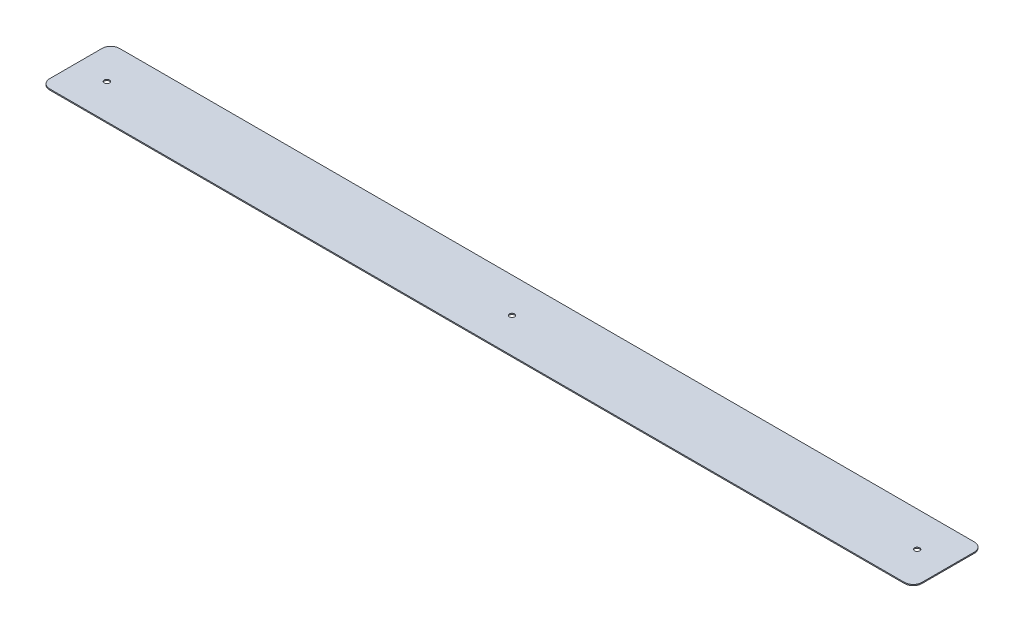
ISO-10303-21;
HEADER;
FILE_DESCRIPTION(('STEP AP214'),'2;1');
FILE_NAME('part.step','',(''),(''),'','','');
FILE_SCHEMA(('AUTOMOTIVE_DESIGN { 1 0 10303 214 1 1 1 1 }'));
ENDSEC;
DATA;
#1=APPLICATION_CONTEXT('core data for automotive mechanical design processes');
#2=APPLICATION_PROTOCOL_DEFINITION('international standard','automotive_design',2000,#1);
#3=PRODUCT_CONTEXT('',#1,'mechanical');
#4=PRODUCT('Part','Part','',(#3));
#5=PRODUCT_RELATED_PRODUCT_CATEGORY('part','',(#4));
#6=PRODUCT_DEFINITION_FORMATION('','',#4);
#7=PRODUCT_DEFINITION_CONTEXT('part definition',#1,'design');
#8=PRODUCT_DEFINITION('design','',#6,#7);
#9=PRODUCT_DEFINITION_SHAPE('','',#8);
#10=(LENGTH_UNIT() NAMED_UNIT(*) SI_UNIT(.MILLI.,.METRE.));
#11=(NAMED_UNIT(*) PLANE_ANGLE_UNIT() SI_UNIT($,.RADIAN.));
#12=(NAMED_UNIT(*) SI_UNIT($,.STERADIAN.) SOLID_ANGLE_UNIT());
#13=UNCERTAINTY_MEASURE_WITH_UNIT(LENGTH_MEASURE(1.E-05),#10,'distance_accuracy_value','');
#14=(GEOMETRIC_REPRESENTATION_CONTEXT(3) GLOBAL_UNCERTAINTY_ASSIGNED_CONTEXT((#13)) GLOBAL_UNIT_ASSIGNED_CONTEXT((#10,
#11,#12)) REPRESENTATION_CONTEXT('',''));
#15=CARTESIAN_POINT('',(0.,0.,0.));
#16=DIRECTION('',(0.,0.,1.));
#17=DIRECTION('',(1.,0.,0.));
#18=AXIS2_PLACEMENT_3D('',#15,#16,#17);
#19=CARTESIAN_POINT('',(0.,0.,0.));
#20=DIRECTION('',(0.,-1.,0.));
#21=DIRECTION('',(0.,0.,-1.));
#22=AXIS2_PLACEMENT_3D('',#19,#20,#21);
#23=PLANE('',#22);
#24=DIRECTION('',(0.,0.,1.));
#25=VECTOR('',#24,1.);
#26=CARTESIAN_POINT('',(-316.7761,0.,25.4));
#27=LINE('',#26,#25);
#28=CARTESIAN_POINT('',(-316.7761,0.,-19.05));
#29=VERTEX_POINT('',#28);
#30=CARTESIAN_POINT('',(-316.7761,0.,19.05));
#31=VERTEX_POINT('',#30);
#32=EDGE_CURVE('E119',#29,#31,#27,.T.);
#33=ORIENTED_EDGE('',*,*,#32,.F.);
#34=CARTESIAN_POINT('',(-310.4261,0.,-19.05));
#35=DIRECTION('',(0.,-1.,0.));
#36=DIRECTION('',(0.,0.,-1.));
#37=AXIS2_PLACEMENT_3D('',#34,#35,#36);
#38=CIRCLE('',#37,6.35);
#39=CARTESIAN_POINT('',(-310.4261,0.,-25.4));
#40=VERTEX_POINT('',#39);
#41=EDGE_CURVE('E102',#29,#40,#38,.T.);
#42=ORIENTED_EDGE('',*,*,#41,.T.);
#43=DIRECTION('',(-1.,0.,0.));
#44=VECTOR('',#43,1.);
#45=CARTESIAN_POINT('',(-316.7761,0.,-25.4));
#46=LINE('',#45,#44);
#47=CARTESIAN_POINT('',(310.4261,0.,-25.4));
#48=VERTEX_POINT('',#47);
#49=EDGE_CURVE('E128',#48,#40,#46,.T.);
#50=ORIENTED_EDGE('',*,*,#49,.F.);
#51=CARTESIAN_POINT('',(310.4261,0.,-19.05));
#52=DIRECTION('',(0.,-1.,0.));
#53=DIRECTION('',(0.,0.,-1.));
#54=AXIS2_PLACEMENT_3D('',#51,#52,#53);
#55=CIRCLE('',#54,6.35);
#56=CARTESIAN_POINT('',(316.7761,0.,-19.05));
#57=VERTEX_POINT('',#56);
#58=EDGE_CURVE('E139',#48,#57,#55,.T.);
#59=ORIENTED_EDGE('',*,*,#58,.T.);
#60=DIRECTION('',(0.,0.,-1.));
#61=VECTOR('',#60,1.);
#62=CARTESIAN_POINT('',(316.7761,0.,25.4));
#63=LINE('',#62,#61);
#64=CARTESIAN_POINT('',(316.7761,0.,19.05));
#65=VERTEX_POINT('',#64);
#66=EDGE_CURVE('E132',#65,#57,#63,.T.);
#67=ORIENTED_EDGE('',*,*,#66,.F.);
#68=CARTESIAN_POINT('',(310.4261,0.,19.05));
#69=DIRECTION('',(0.,-1.,0.));
#70=DIRECTION('',(0.,0.,-1.));
#71=AXIS2_PLACEMENT_3D('',#68,#69,#70);
#72=CIRCLE('',#71,6.35);
#73=CARTESIAN_POINT('',(310.4261,0.,25.4));
#74=VERTEX_POINT('',#73);
#75=EDGE_CURVE('E122',#65,#74,#72,.T.);
#76=ORIENTED_EDGE('',*,*,#75,.T.);
#77=DIRECTION('',(1.,0.,0.));
#78=VECTOR('',#77,1.);
#79=CARTESIAN_POINT('',(-316.7761,0.,25.4));
#80=LINE('',#79,#78);
#81=CARTESIAN_POINT('',(-310.4261,0.,25.4));
#82=VERTEX_POINT('',#81);
#83=EDGE_CURVE('E127',#82,#74,#80,.T.);
#84=ORIENTED_EDGE('',*,*,#83,.F.);
#85=CARTESIAN_POINT('',(-310.4261,0.,19.05));
#86=DIRECTION('',(0.,-1.,0.));
#87=DIRECTION('',(0.,0.,-1.));
#88=AXIS2_PLACEMENT_3D('',#85,#86,#87);
#89=CIRCLE('',#88,6.35);
#90=EDGE_CURVE('E113',#82,#31,#89,.T.);
#91=ORIENTED_EDGE('',*,*,#90,.T.);
#92=EDGE_LOOP('',(#33,#42,#50,#59,#67,#76,#84,#91));
#93=FACE_BOUND('',#92,.T.);
#94=CARTESIAN_POINT('',(294.256791216,0.,0.));
#95=DIRECTION('',(0.,1.,0.));
#96=DIRECTION('',(0.,0.,1.));
#97=AXIS2_PLACEMENT_3D('',#94,#95,#96);
#98=CIRCLE('',#97,1.89865);
#99=CARTESIAN_POINT('',(294.256791216,0.,1.89865));
#100=VERTEX_POINT('',#99);
#101=EDGE_CURVE('E166',#100,#100,#98,.T.);
#102=ORIENTED_EDGE('',*,*,#101,.T.);
#103=EDGE_LOOP('',(#102));
#104=FACE_BOUND('',#103,.T.);
#105=CARTESIAN_POINT('',(-294.256791216,0.,0.));
#106=DIRECTION('',(0.,1.,0.));
#107=DIRECTION('',(0.,0.,1.));
#108=AXIS2_PLACEMENT_3D('',#105,#106,#107);
#109=CIRCLE('',#108,1.89865);
#110=CARTESIAN_POINT('',(-294.256791216,0.,1.89865));
#111=VERTEX_POINT('',#110);
#112=EDGE_CURVE('E179',#111,#111,#109,.T.);
#113=ORIENTED_EDGE('',*,*,#112,.T.);
#114=EDGE_LOOP('',(#113));
#115=FACE_BOUND('',#114,.T.);
#116=CARTESIAN_POINT('',(0.,0.,0.));
#117=DIRECTION('',(0.,1.,0.));
#118=DIRECTION('',(0.,0.,1.));
#119=AXIS2_PLACEMENT_3D('',#116,#117,#118);
#120=CIRCLE('',#119,1.89865);
#121=CARTESIAN_POINT('',(0.,0.,1.89865));
#122=VERTEX_POINT('',#121);
#123=EDGE_CURVE('E185',#122,#122,#120,.T.);
#124=ORIENTED_EDGE('',*,*,#123,.T.);
#125=EDGE_LOOP('',(#124));
#126=FACE_BOUND('',#125,.T.);
#127=ADVANCED_FACE('F36',(#93,#104,#115,#126),#23,.T.);
#128=CARTESIAN_POINT('',(316.7761,0.79375,25.4));
#129=DIRECTION('',(-1.,0.,0.));
#130=DIRECTION('',(0.,0.,1.));
#131=AXIS2_PLACEMENT_3D('',#128,#129,#130);
#132=PLANE('',#131);
#133=ORIENTED_EDGE('',*,*,#66,.T.);
#134=DIRECTION('',(0.,-1.,0.));
#135=VECTOR('',#134,1.);
#136=CARTESIAN_POINT('',(316.7761,0.79375,-19.05));
#137=LINE('',#136,#135);
#138=CARTESIAN_POINT('',(316.7761,0.79375,-19.05));
#139=VERTEX_POINT('',#138);
#140=EDGE_CURVE('E11',#57,#139,#137,.F.);
#141=ORIENTED_EDGE('',*,*,#140,.T.);
#142=DIRECTION('',(0.,0.,-1.));
#143=VECTOR('',#142,1.);
#144=CARTESIAN_POINT('',(316.7761,0.79375,25.4));
#145=LINE('',#144,#143);
#146=CARTESIAN_POINT('',(316.7761,0.79375,19.05));
#147=VERTEX_POINT('',#146);
#148=EDGE_CURVE('E130',#147,#139,#145,.T.);
#149=ORIENTED_EDGE('',*,*,#148,.F.);
#150=DIRECTION('',(0.,-1.,0.));
#151=VECTOR('',#150,1.);
#152=CARTESIAN_POINT('',(316.7761,0.79375,19.05));
#153=LINE('',#152,#151);
#154=EDGE_CURVE('E44',#147,#65,#153,.T.);
#155=ORIENTED_EDGE('',*,*,#154,.T.);
#156=EDGE_LOOP('',(#133,#141,#149,#155));
#157=FACE_BOUND('',#156,.T.);
#158=ADVANCED_FACE('F161',(#157),#132,.F.);
#159=CARTESIAN_POINT('',(-316.7761,0.79375,-25.4));
#160=DIRECTION('',(0.,0.,1.));
#161=DIRECTION('',(1.,0.,0.));
#162=AXIS2_PLACEMENT_3D('',#159,#160,#161);
#163=PLANE('',#162);
#164=ORIENTED_EDGE('',*,*,#49,.T.);
#165=DIRECTION('',(0.,-1.,0.));
#166=VECTOR('',#165,1.);
#167=CARTESIAN_POINT('',(-310.4261,0.79375,-25.4));
#168=LINE('',#167,#166);
#169=CARTESIAN_POINT('',(-310.4261,0.79375,-25.4));
#170=VERTEX_POINT('',#169);
#171=EDGE_CURVE('E107',#40,#170,#168,.F.);
#172=ORIENTED_EDGE('',*,*,#171,.T.);
#173=DIRECTION('',(-1.,0.,0.));
#174=VECTOR('',#173,1.);
#175=CARTESIAN_POINT('',(-316.7761,0.79375,-25.4));
#176=LINE('',#175,#174);
#177=CARTESIAN_POINT('',(310.4261,0.79375,-25.4));
#178=VERTEX_POINT('',#177);
#179=EDGE_CURVE('E173',#178,#170,#176,.T.);
#180=ORIENTED_EDGE('',*,*,#179,.F.);
#181=DIRECTION('',(0.,-1.,0.));
#182=VECTOR('',#181,1.);
#183=CARTESIAN_POINT('',(310.4261,0.79375,-25.4));
#184=LINE('',#183,#182);
#185=EDGE_CURVE('E112',#178,#48,#184,.T.);
#186=ORIENTED_EDGE('',*,*,#185,.T.);
#187=EDGE_LOOP('',(#164,#172,#180,#186));
#188=FACE_BOUND('',#187,.T.);
#189=ADVANCED_FACE('F206',(#188),#163,.F.);
#190=CARTESIAN_POINT('',(-316.7761,0.79375,25.4));
#191=DIRECTION('',(1.,0.,0.));
#192=DIRECTION('',(0.,0.,-1.));
#193=AXIS2_PLACEMENT_3D('',#190,#191,#192);
#194=PLANE('',#193);
#195=DIRECTION('',(0.,0.,1.));
#196=VECTOR('',#195,1.);
#197=CARTESIAN_POINT('',(-316.7761,0.79375,25.4));
#198=LINE('',#197,#196);
#199=CARTESIAN_POINT('',(-316.7761,0.79375,-19.05));
#200=VERTEX_POINT('',#199);
#201=CARTESIAN_POINT('',(-316.7761,0.79375,19.05));
#202=VERTEX_POINT('',#201);
#203=EDGE_CURVE('E121',#200,#202,#198,.T.);
#204=ORIENTED_EDGE('',*,*,#203,.F.);
#205=DIRECTION('',(0.,-1.,0.));
#206=VECTOR('',#205,1.);
#207=CARTESIAN_POINT('',(-316.7761,0.79375,-19.05));
#208=LINE('',#207,#206);
#209=EDGE_CURVE('E106',#200,#29,#208,.T.);
#210=ORIENTED_EDGE('',*,*,#209,.T.);
#211=ORIENTED_EDGE('',*,*,#32,.T.);
#212=DIRECTION('',(0.,-1.,0.));
#213=VECTOR('',#212,1.);
#214=CARTESIAN_POINT('',(-316.7761,0.79375,19.05));
#215=LINE('',#214,#213);
#216=EDGE_CURVE('E123',#31,#202,#215,.F.);
#217=ORIENTED_EDGE('',*,*,#216,.T.);
#218=EDGE_LOOP('',(#204,#210,#211,#217));
#219=FACE_BOUND('',#218,.T.);
#220=ADVANCED_FACE('F118',(#219),#194,.F.);
#221=CARTESIAN_POINT('',(-316.7761,0.79375,25.4));
#222=DIRECTION('',(0.,0.,-1.));
#223=DIRECTION('',(-1.,0.,0.));
#224=AXIS2_PLACEMENT_3D('',#221,#222,#223);
#225=PLANE('',#224);
#226=DIRECTION('',(1.,0.,0.));
#227=VECTOR('',#226,1.);
#228=CARTESIAN_POINT('',(-316.7761,0.79375,25.4));
#229=LINE('',#228,#227);
#230=CARTESIAN_POINT('',(-310.4261,0.79375,25.4));
#231=VERTEX_POINT('',#230);
#232=CARTESIAN_POINT('',(310.4261,0.79375,25.4));
#233=VERTEX_POINT('',#232);
#234=EDGE_CURVE('E136',#231,#233,#229,.T.);
#235=ORIENTED_EDGE('',*,*,#234,.F.);
#236=DIRECTION('',(0.,-1.,0.));
#237=VECTOR('',#236,1.);
#238=CARTESIAN_POINT('',(-310.4261,0.79375,25.4));
#239=LINE('',#238,#237);
#240=EDGE_CURVE('E153',#231,#82,#239,.T.);
#241=ORIENTED_EDGE('',*,*,#240,.T.);
#242=ORIENTED_EDGE('',*,*,#83,.T.);
#243=DIRECTION('',(0.,-1.,0.));
#244=VECTOR('',#243,1.);
#245=CARTESIAN_POINT('',(310.4261,0.79375,25.4));
#246=LINE('',#245,#244);
#247=EDGE_CURVE('E51',#74,#233,#246,.F.);
#248=ORIENTED_EDGE('',*,*,#247,.T.);
#249=EDGE_LOOP('',(#235,#241,#242,#248));
#250=FACE_BOUND('',#249,.T.);
#251=ADVANCED_FACE('F197',(#250),#225,.F.);
#252=CARTESIAN_POINT('',(0.,0.79375,0.));
#253=DIRECTION('',(0.,-1.,0.));
#254=DIRECTION('',(0.,0.,-1.));
#255=AXIS2_PLACEMENT_3D('',#252,#253,#254);
#256=PLANE('',#255);
#257=CARTESIAN_POINT('',(0.,0.79375,0.));
#258=DIRECTION('',(0.,1.,0.));
#259=DIRECTION('',(0.,0.,1.));
#260=AXIS2_PLACEMENT_3D('',#257,#258,#259);
#261=CIRCLE('',#260,1.89865);
#262=CARTESIAN_POINT('',(0.,0.79375,1.89865));
#263=VERTEX_POINT('',#262);
#264=EDGE_CURVE('E188',#263,#263,#261,.T.);
#265=ORIENTED_EDGE('',*,*,#264,.F.);
#266=EDGE_LOOP('',(#265));
#267=FACE_BOUND('',#266,.T.);
#268=CARTESIAN_POINT('',(-294.256791216,0.79375,0.));
#269=DIRECTION('',(0.,1.,0.));
#270=DIRECTION('',(0.,0.,1.));
#271=AXIS2_PLACEMENT_3D('',#268,#269,#270);
#272=CIRCLE('',#271,1.89865);
#273=CARTESIAN_POINT('',(-294.256791216,0.79375,1.89865));
#274=VERTEX_POINT('',#273);
#275=EDGE_CURVE('E182',#274,#274,#272,.T.);
#276=ORIENTED_EDGE('',*,*,#275,.F.);
#277=EDGE_LOOP('',(#276));
#278=FACE_BOUND('',#277,.T.);
#279=CARTESIAN_POINT('',(294.256791216,0.79375,0.));
#280=DIRECTION('',(0.,1.,0.));
#281=DIRECTION('',(0.,0.,1.));
#282=AXIS2_PLACEMENT_3D('',#279,#280,#281);
#283=CIRCLE('',#282,1.89865);
#284=CARTESIAN_POINT('',(294.256791216,0.79375,1.89865));
#285=VERTEX_POINT('',#284);
#286=EDGE_CURVE('E168',#285,#285,#283,.T.);
#287=ORIENTED_EDGE('',*,*,#286,.F.);
#288=EDGE_LOOP('',(#287));
#289=FACE_BOUND('',#288,.T.);
#290=ORIENTED_EDGE('',*,*,#179,.T.);
#291=CARTESIAN_POINT('',(-310.4261,0.79375,-19.05));
#292=DIRECTION('',(0.,-1.,0.));
#293=DIRECTION('',(0.,0.,-1.));
#294=AXIS2_PLACEMENT_3D('',#291,#292,#293);
#295=CIRCLE('',#294,6.35);
#296=EDGE_CURVE('E150',#170,#200,#295,.F.);
#297=ORIENTED_EDGE('',*,*,#296,.T.);
#298=ORIENTED_EDGE('',*,*,#203,.T.);
#299=CARTESIAN_POINT('',(-310.4261,0.79375,19.05));
#300=DIRECTION('',(0.,-1.,0.));
#301=DIRECTION('',(0.,0.,-1.));
#302=AXIS2_PLACEMENT_3D('',#299,#300,#301);
#303=CIRCLE('',#302,6.35);
#304=EDGE_CURVE('E58',#202,#231,#303,.F.);
#305=ORIENTED_EDGE('',*,*,#304,.T.);
#306=ORIENTED_EDGE('',*,*,#234,.T.);
#307=CARTESIAN_POINT('',(310.4261,0.79375,19.05));
#308=DIRECTION('',(0.,-1.,0.));
#309=DIRECTION('',(0.,0.,-1.));
#310=AXIS2_PLACEMENT_3D('',#307,#308,#309);
#311=CIRCLE('',#310,6.35);
#312=EDGE_CURVE('E145',#233,#147,#311,.F.);
#313=ORIENTED_EDGE('',*,*,#312,.T.);
#314=ORIENTED_EDGE('',*,*,#148,.T.);
#315=CARTESIAN_POINT('',(310.4261,0.79375,-19.05));
#316=DIRECTION('',(0.,-1.,0.));
#317=DIRECTION('',(0.,0.,-1.));
#318=AXIS2_PLACEMENT_3D('',#315,#316,#317);
#319=CIRCLE('',#318,6.35);
#320=EDGE_CURVE('E147',#139,#178,#319,.F.);
#321=ORIENTED_EDGE('',*,*,#320,.T.);
#322=EDGE_LOOP('',(#290,#297,#298,#305,#306,#313,#314,#321));
#323=FACE_BOUND('',#322,.T.);
#324=ADVANCED_FACE('F194',(#267,#278,#289,#323),#256,.F.);
#325=CARTESIAN_POINT('',(-310.4261,0.79375,-19.05));
#326=DIRECTION('',(0.,-1.,0.));
#327=DIRECTION('',(0.,0.,-1.));
#328=AXIS2_PLACEMENT_3D('',#325,#326,#327);
#329=CYLINDRICAL_SURFACE('',#328,6.35);
#330=ORIENTED_EDGE('',*,*,#296,.F.);
#331=ORIENTED_EDGE('',*,*,#171,.F.);
#332=ORIENTED_EDGE('',*,*,#41,.F.);
#333=ORIENTED_EDGE('',*,*,#209,.F.);
#334=EDGE_LOOP('',(#330,#331,#332,#333));
#335=FACE_BOUND('',#334,.T.);
#336=ADVANCED_FACE('F105',(#335),#329,.T.);
#337=CARTESIAN_POINT('',(-310.4261,0.79375,19.05));
#338=DIRECTION('',(0.,-1.,0.));
#339=DIRECTION('',(0.,0.,-1.));
#340=AXIS2_PLACEMENT_3D('',#337,#338,#339);
#341=CYLINDRICAL_SURFACE('',#340,6.35);
#342=ORIENTED_EDGE('',*,*,#304,.F.);
#343=ORIENTED_EDGE('',*,*,#216,.F.);
#344=ORIENTED_EDGE('',*,*,#90,.F.);
#345=ORIENTED_EDGE('',*,*,#240,.F.);
#346=EDGE_LOOP('',(#342,#343,#344,#345));
#347=FACE_BOUND('',#346,.T.);
#348=ADVANCED_FACE('F218',(#347),#341,.T.);
#349=CARTESIAN_POINT('',(310.4261,0.79375,-19.05));
#350=DIRECTION('',(0.,-1.,0.));
#351=DIRECTION('',(0.,0.,-1.));
#352=AXIS2_PLACEMENT_3D('',#349,#350,#351);
#353=CYLINDRICAL_SURFACE('',#352,6.35);
#354=ORIENTED_EDGE('',*,*,#320,.F.);
#355=ORIENTED_EDGE('',*,*,#140,.F.);
#356=ORIENTED_EDGE('',*,*,#58,.F.);
#357=ORIENTED_EDGE('',*,*,#185,.F.);
#358=EDGE_LOOP('',(#354,#355,#356,#357));
#359=FACE_BOUND('',#358,.T.);
#360=ADVANCED_FACE('F208',(#359),#353,.T.);
#361=CARTESIAN_POINT('',(310.4261,0.79375,19.05));
#362=DIRECTION('',(0.,-1.,0.));
#363=DIRECTION('',(0.,0.,-1.));
#364=AXIS2_PLACEMENT_3D('',#361,#362,#363);
#365=CYLINDRICAL_SURFACE('',#364,6.35);
#366=ORIENTED_EDGE('',*,*,#312,.F.);
#367=ORIENTED_EDGE('',*,*,#247,.F.);
#368=ORIENTED_EDGE('',*,*,#75,.F.);
#369=ORIENTED_EDGE('',*,*,#154,.F.);
#370=EDGE_LOOP('',(#366,#367,#368,#369));
#371=FACE_BOUND('',#370,.T.);
#372=ADVANCED_FACE('F38',(#371),#365,.T.);
#373=CARTESIAN_POINT('',(294.256791216,0.79375,0.));
#374=DIRECTION('',(0.,1.,0.));
#375=DIRECTION('',(0.,0.,1.));
#376=AXIS2_PLACEMENT_3D('',#373,#374,#375);
#377=CYLINDRICAL_SURFACE('',#376,1.89865);
#378=ORIENTED_EDGE('',*,*,#101,.F.);
#379=EDGE_LOOP('',(#378));
#380=FACE_BOUND('',#379,.T.);
#381=ORIENTED_EDGE('',*,*,#286,.T.);
#382=EDGE_LOOP('',(#381));
#383=FACE_BOUND('',#382,.T.);
#384=ADVANCED_FACE('F210',(#380,#383),#377,.F.);
#385=CARTESIAN_POINT('',(-294.256791216,0.79375,0.));
#386=DIRECTION('',(0.,1.,0.));
#387=DIRECTION('',(0.,0.,1.));
#388=AXIS2_PLACEMENT_3D('',#385,#386,#387);
#389=CYLINDRICAL_SURFACE('',#388,1.89865);
#390=ORIENTED_EDGE('',*,*,#112,.F.);
#391=EDGE_LOOP('',(#390));
#392=FACE_BOUND('',#391,.T.);
#393=ORIENTED_EDGE('',*,*,#275,.T.);
#394=EDGE_LOOP('',(#393));
#395=FACE_BOUND('',#394,.T.);
#396=ADVANCED_FACE('F215',(#392,#395),#389,.F.);
#397=CARTESIAN_POINT('',(0.,0.79375,0.));
#398=DIRECTION('',(0.,1.,0.));
#399=DIRECTION('',(0.,0.,1.));
#400=AXIS2_PLACEMENT_3D('',#397,#398,#399);
#401=CYLINDRICAL_SURFACE('',#400,1.89865);
#402=ORIENTED_EDGE('',*,*,#123,.F.);
#403=EDGE_LOOP('',(#402));
#404=FACE_BOUND('',#403,.T.);
#405=ORIENTED_EDGE('',*,*,#264,.T.);
#406=EDGE_LOOP('',(#405));
#407=FACE_BOUND('',#406,.T.);
#408=ADVANCED_FACE('F192',(#404,#407),#401,.F.);
#409=CLOSED_SHELL('',(#127,#158,#189,#220,#251,#324,#336,#348,#360,#372,#384,#396,#408));
#410=MANIFOLD_SOLID_BREP('B2',#409);
#411=ADVANCED_BREP_SHAPE_REPRESENTATION('',(#18,#410),#14);
#412=SHAPE_DEFINITION_REPRESENTATION(#9,#411);
ENDSEC;
END-ISO-10303-21;
